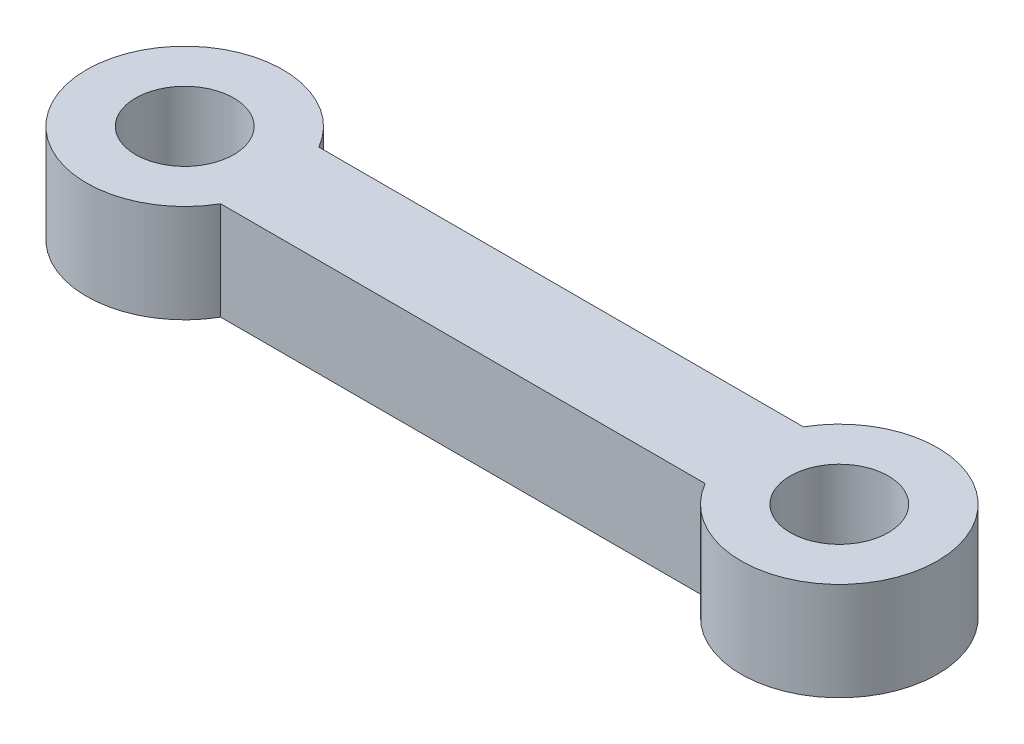
ISO-10303-21;
HEADER;
FILE_DESCRIPTION(('STEP AP214'),'2;1');
FILE_NAME('part.step','',(''),(''),'','','');
FILE_SCHEMA(('AUTOMOTIVE_DESIGN { 1 0 10303 214 1 1 1 1 }'));
ENDSEC;
DATA;
#1=APPLICATION_CONTEXT('core data for automotive mechanical design processes');
#2=APPLICATION_PROTOCOL_DEFINITION('international standard','automotive_design',2000,#1);
#3=PRODUCT_CONTEXT('',#1,'mechanical');
#4=PRODUCT('Part','Part','',(#3));
#5=PRODUCT_RELATED_PRODUCT_CATEGORY('part','',(#4));
#6=PRODUCT_DEFINITION_FORMATION('','',#4);
#7=PRODUCT_DEFINITION_CONTEXT('part definition',#1,'design');
#8=PRODUCT_DEFINITION('design','',#6,#7);
#9=PRODUCT_DEFINITION_SHAPE('','',#8);
#10=(LENGTH_UNIT() NAMED_UNIT(*) SI_UNIT(.MILLI.,.METRE.));
#11=(NAMED_UNIT(*) PLANE_ANGLE_UNIT() SI_UNIT($,.RADIAN.));
#12=(NAMED_UNIT(*) SI_UNIT($,.STERADIAN.) SOLID_ANGLE_UNIT());
#13=UNCERTAINTY_MEASURE_WITH_UNIT(LENGTH_MEASURE(1.E-05),#10,'distance_accuracy_value','');
#14=(GEOMETRIC_REPRESENTATION_CONTEXT(3) GLOBAL_UNCERTAINTY_ASSIGNED_CONTEXT((#13)) GLOBAL_UNIT_ASSIGNED_CONTEXT((#10,
#11,#12)) REPRESENTATION_CONTEXT('',''));
#15=CARTESIAN_POINT('',(0.,0.,0.));
#16=DIRECTION('',(0.,0.,1.));
#17=DIRECTION('',(1.,0.,0.));
#18=AXIS2_PLACEMENT_3D('',#15,#16,#17);
#19=CARTESIAN_POINT('',(0.,3.,1.5));
#20=DIRECTION('',(0.,0.,1.));
#21=DIRECTION('',(1.,0.,0.));
#22=AXIS2_PLACEMENT_3D('',#19,#20,#21);
#23=PLANE('',#22);
#24=DIRECTION('',(-1.,0.,0.));
#25=VECTOR('',#24,1.);
#26=CARTESIAN_POINT('',(0.,0.,1.5));
#27=LINE('',#26,#25);
#28=CARTESIAN_POINT('',(17.4019237886467,0.,1.50000000000001));
#29=VERTEX_POINT('',#28);
#30=CARTESIAN_POINT('',(2.59807621135332,0.,1.5));
#31=VERTEX_POINT('',#30);
#32=EDGE_CURVE('E116',#29,#31,#27,.T.);
#33=ORIENTED_EDGE('',*,*,#32,.F.);
#34=DIRECTION('',(0.,-1.,0.));
#35=VECTOR('',#34,1.);
#36=CARTESIAN_POINT('',(17.4019237886467,3.,1.50000000000001));
#37=LINE('',#36,#35);
#38=CARTESIAN_POINT('',(17.4019237886467,3.,1.50000000000001));
#39=VERTEX_POINT('',#38);
#40=EDGE_CURVE('E13',#39,#29,#37,.T.);
#41=ORIENTED_EDGE('',*,*,#40,.F.);
#42=DIRECTION('',(-1.,0.,0.));
#43=VECTOR('',#42,1.);
#44=CARTESIAN_POINT('',(0.,3.,1.5));
#45=LINE('',#44,#43);
#46=CARTESIAN_POINT('',(2.59807621135332,3.,1.5));
#47=VERTEX_POINT('',#46);
#48=EDGE_CURVE('E95',#39,#47,#45,.T.);
#49=ORIENTED_EDGE('',*,*,#48,.T.);
#50=DIRECTION('',(0.,-1.,0.));
#51=VECTOR('',#50,1.);
#52=CARTESIAN_POINT('',(2.59807621135332,3.,1.5));
#53=LINE('',#52,#51);
#54=EDGE_CURVE('E85',#47,#31,#53,.T.);
#55=ORIENTED_EDGE('',*,*,#54,.T.);
#56=EDGE_LOOP('',(#33,#41,#49,#55));
#57=FACE_BOUND('',#56,.T.);
#58=ADVANCED_FACE('F46',(#57),#23,.T.);
#59=CARTESIAN_POINT('',(20.,3.,0.));
#60=DIRECTION('',(0.,-1.,0.));
#61=DIRECTION('',(0.,0.,-1.));
#62=AXIS2_PLACEMENT_3D('',#59,#60,#61);
#63=CYLINDRICAL_SURFACE('',#62,3.);
#64=CARTESIAN_POINT('',(20.,0.,0.));
#65=DIRECTION('',(0.,1.,0.));
#66=DIRECTION('',(0.,0.,1.));
#67=AXIS2_PLACEMENT_3D('',#64,#65,#66);
#68=CIRCLE('',#67,3.);
#69=CARTESIAN_POINT('',(17.4019237886467,0.,-1.5));
#70=VERTEX_POINT('',#69);
#71=EDGE_CURVE('E101',#29,#70,#68,.T.);
#72=ORIENTED_EDGE('',*,*,#71,.T.);
#73=DIRECTION('',(0.,-1.,0.));
#74=VECTOR('',#73,1.);
#75=CARTESIAN_POINT('',(17.4019237886467,3.,-1.49999999999999));
#76=LINE('',#75,#74);
#77=CARTESIAN_POINT('',(17.4019237886467,3.,-1.49999999999999));
#78=VERTEX_POINT('',#77);
#79=EDGE_CURVE('E55',#78,#70,#76,.T.);
#80=ORIENTED_EDGE('',*,*,#79,.F.);
#81=CARTESIAN_POINT('',(20.,3.,0.));
#82=DIRECTION('',(0.,1.,0.));
#83=DIRECTION('',(0.,0.,1.));
#84=AXIS2_PLACEMENT_3D('',#81,#82,#83);
#85=CIRCLE('',#84,3.);
#86=EDGE_CURVE('E90',#39,#78,#85,.T.);
#87=ORIENTED_EDGE('',*,*,#86,.F.);
#88=ORIENTED_EDGE('',*,*,#40,.T.);
#89=EDGE_LOOP('',(#72,#80,#87,#88));
#90=FACE_BOUND('',#89,.T.);
#91=ADVANCED_FACE('F99',(#90),#63,.T.);
#92=CARTESIAN_POINT('',(0.,3.,-1.5));
#93=DIRECTION('',(0.,0.,-1.));
#94=DIRECTION('',(-1.,0.,0.));
#95=AXIS2_PLACEMENT_3D('',#92,#93,#94);
#96=PLANE('',#95);
#97=DIRECTION('',(1.,0.,0.));
#98=VECTOR('',#97,1.);
#99=CARTESIAN_POINT('',(0.,0.,-1.5));
#100=LINE('',#99,#98);
#101=CARTESIAN_POINT('',(2.59807621135331,0.,-1.5));
#102=VERTEX_POINT('',#101);
#103=EDGE_CURVE('E120',#102,#70,#100,.T.);
#104=ORIENTED_EDGE('',*,*,#103,.F.);
#105=DIRECTION('',(0.,-1.,0.));
#106=VECTOR('',#105,1.);
#107=CARTESIAN_POINT('',(2.59807621135332,3.,-1.5));
#108=LINE('',#107,#106);
#109=CARTESIAN_POINT('',(2.59807621135332,3.,-1.5));
#110=VERTEX_POINT('',#109);
#111=EDGE_CURVE('E78',#110,#102,#108,.T.);
#112=ORIENTED_EDGE('',*,*,#111,.F.);
#113=DIRECTION('',(1.,0.,0.));
#114=VECTOR('',#113,1.);
#115=CARTESIAN_POINT('',(0.,3.,-1.5));
#116=LINE('',#115,#114);
#117=EDGE_CURVE('E94',#110,#78,#116,.T.);
#118=ORIENTED_EDGE('',*,*,#117,.T.);
#119=ORIENTED_EDGE('',*,*,#79,.T.);
#120=EDGE_LOOP('',(#104,#112,#118,#119));
#121=FACE_BOUND('',#120,.T.);
#122=ADVANCED_FACE('F105',(#121),#96,.T.);
#123=CARTESIAN_POINT('',(20.,3.,0.));
#124=DIRECTION('',(0.,-1.,0.));
#125=DIRECTION('',(0.,0.,-1.));
#126=AXIS2_PLACEMENT_3D('',#123,#124,#125);
#127=CYLINDRICAL_SURFACE('',#126,1.5);
#128=CARTESIAN_POINT('',(20.,3.,0.));
#129=DIRECTION('',(0.,1.,0.));
#130=DIRECTION('',(0.,0.,1.));
#131=AXIS2_PLACEMENT_3D('',#128,#129,#130);
#132=CIRCLE('',#131,1.5);
#133=CARTESIAN_POINT('',(20.,3.,1.50000000000001));
#134=VERTEX_POINT('',#133);
#135=EDGE_CURVE('E127',#134,#134,#132,.T.);
#136=ORIENTED_EDGE('',*,*,#135,.T.);
#137=EDGE_LOOP('',(#136));
#138=FACE_BOUND('',#137,.T.);
#139=CARTESIAN_POINT('',(20.,0.,0.));
#140=DIRECTION('',(0.,1.,0.));
#141=DIRECTION('',(0.,0.,1.));
#142=AXIS2_PLACEMENT_3D('',#139,#140,#141);
#143=CIRCLE('',#142,1.5);
#144=CARTESIAN_POINT('',(20.,0.,1.50000000000001));
#145=VERTEX_POINT('',#144);
#146=EDGE_CURVE('E113',#145,#145,#143,.T.);
#147=ORIENTED_EDGE('',*,*,#146,.F.);
#148=EDGE_LOOP('',(#147));
#149=FACE_BOUND('',#148,.T.);
#150=ADVANCED_FACE('F140',(#138,#149),#127,.F.);
#151=CARTESIAN_POINT('',(0.,3.,0.));
#152=DIRECTION('',(0.,-1.,0.));
#153=DIRECTION('',(0.,0.,-1.));
#154=AXIS2_PLACEMENT_3D('',#151,#152,#153);
#155=CYLINDRICAL_SURFACE('',#154,1.5);
#156=CARTESIAN_POINT('',(0.,3.,0.));
#157=DIRECTION('',(0.,1.,0.));
#158=DIRECTION('',(0.,0.,1.));
#159=AXIS2_PLACEMENT_3D('',#156,#157,#158);
#160=CIRCLE('',#159,1.5);
#161=CARTESIAN_POINT('',(0.,3.,1.5));
#162=VERTEX_POINT('',#161);
#163=EDGE_CURVE('E124',#162,#162,#160,.T.);
#164=ORIENTED_EDGE('',*,*,#163,.T.);
#165=EDGE_LOOP('',(#164));
#166=FACE_BOUND('',#165,.T.);
#167=CARTESIAN_POINT('',(0.,0.,0.));
#168=DIRECTION('',(0.,1.,0.));
#169=DIRECTION('',(0.,0.,1.));
#170=AXIS2_PLACEMENT_3D('',#167,#168,#169);
#171=CIRCLE('',#170,1.5);
#172=CARTESIAN_POINT('',(0.,0.,1.5));
#173=VERTEX_POINT('',#172);
#174=EDGE_CURVE('E110',#173,#173,#171,.T.);
#175=ORIENTED_EDGE('',*,*,#174,.F.);
#176=EDGE_LOOP('',(#175));
#177=FACE_BOUND('',#176,.T.);
#178=ADVANCED_FACE('F48',(#166,#177),#155,.F.);
#179=CARTESIAN_POINT('',(0.,3.,0.));
#180=DIRECTION('',(0.,-1.,0.));
#181=DIRECTION('',(0.,0.,-1.));
#182=AXIS2_PLACEMENT_3D('',#179,#180,#181);
#183=CYLINDRICAL_SURFACE('',#182,3.);
#184=CARTESIAN_POINT('',(0.,0.,0.));
#185=DIRECTION('',(0.,1.,0.));
#186=DIRECTION('',(0.,0.,1.));
#187=AXIS2_PLACEMENT_3D('',#184,#185,#186);
#188=CIRCLE('',#187,3.);
#189=EDGE_CURVE('E122',#102,#31,#188,.T.);
#190=ORIENTED_EDGE('',*,*,#189,.T.);
#191=ORIENTED_EDGE('',*,*,#54,.F.);
#192=CARTESIAN_POINT('',(0.,3.,0.));
#193=DIRECTION('',(0.,1.,0.));
#194=DIRECTION('',(0.,0.,1.));
#195=AXIS2_PLACEMENT_3D('',#192,#193,#194);
#196=CIRCLE('',#195,3.);
#197=EDGE_CURVE('E63',#110,#47,#196,.T.);
#198=ORIENTED_EDGE('',*,*,#197,.F.);
#199=ORIENTED_EDGE('',*,*,#111,.T.);
#200=EDGE_LOOP('',(#190,#191,#198,#199));
#201=FACE_BOUND('',#200,.T.);
#202=ADVANCED_FACE('F147',(#201),#183,.T.);
#203=CARTESIAN_POINT('',(0.,3.,0.));
#204=DIRECTION('',(0.,1.,0.));
#205=DIRECTION('',(0.,0.,1.));
#206=AXIS2_PLACEMENT_3D('',#203,#204,#205);
#207=PLANE('',#206);
#208=ORIENTED_EDGE('',*,*,#163,.F.);
#209=EDGE_LOOP('',(#208));
#210=FACE_BOUND('',#209,.T.);
#211=ORIENTED_EDGE('',*,*,#135,.F.);
#212=EDGE_LOOP('',(#211));
#213=FACE_BOUND('',#212,.T.);
#214=ORIENTED_EDGE('',*,*,#48,.F.);
#215=ORIENTED_EDGE('',*,*,#86,.T.);
#216=ORIENTED_EDGE('',*,*,#117,.F.);
#217=ORIENTED_EDGE('',*,*,#197,.T.);
#218=EDGE_LOOP('',(#214,#215,#216,#217));
#219=FACE_BOUND('',#218,.T.);
#220=ADVANCED_FACE('F92',(#210,#213,#219),#207,.T.);
#221=CARTESIAN_POINT('',(0.,0.,0.));
#222=DIRECTION('',(0.,1.,0.));
#223=DIRECTION('',(0.,0.,1.));
#224=AXIS2_PLACEMENT_3D('',#221,#222,#223);
#225=PLANE('',#224);
#226=ORIENTED_EDGE('',*,*,#174,.T.);
#227=EDGE_LOOP('',(#226));
#228=FACE_BOUND('',#227,.T.);
#229=ORIENTED_EDGE('',*,*,#146,.T.);
#230=EDGE_LOOP('',(#229));
#231=FACE_BOUND('',#230,.T.);
#232=ORIENTED_EDGE('',*,*,#32,.T.);
#233=ORIENTED_EDGE('',*,*,#189,.F.);
#234=ORIENTED_EDGE('',*,*,#103,.T.);
#235=ORIENTED_EDGE('',*,*,#71,.F.);
#236=EDGE_LOOP('',(#232,#233,#234,#235));
#237=FACE_BOUND('',#236,.T.);
#238=ADVANCED_FACE('F152',(#228,#231,#237),#225,.F.);
#239=CLOSED_SHELL('',(#58,#91,#122,#150,#178,#202,#220,#238));
#240=MANIFOLD_SOLID_BREP('B2',#239);
#241=ADVANCED_BREP_SHAPE_REPRESENTATION('',(#18,#240),#14);
#242=SHAPE_DEFINITION_REPRESENTATION(#9,#241);
ENDSEC;
END-ISO-10303-21;
